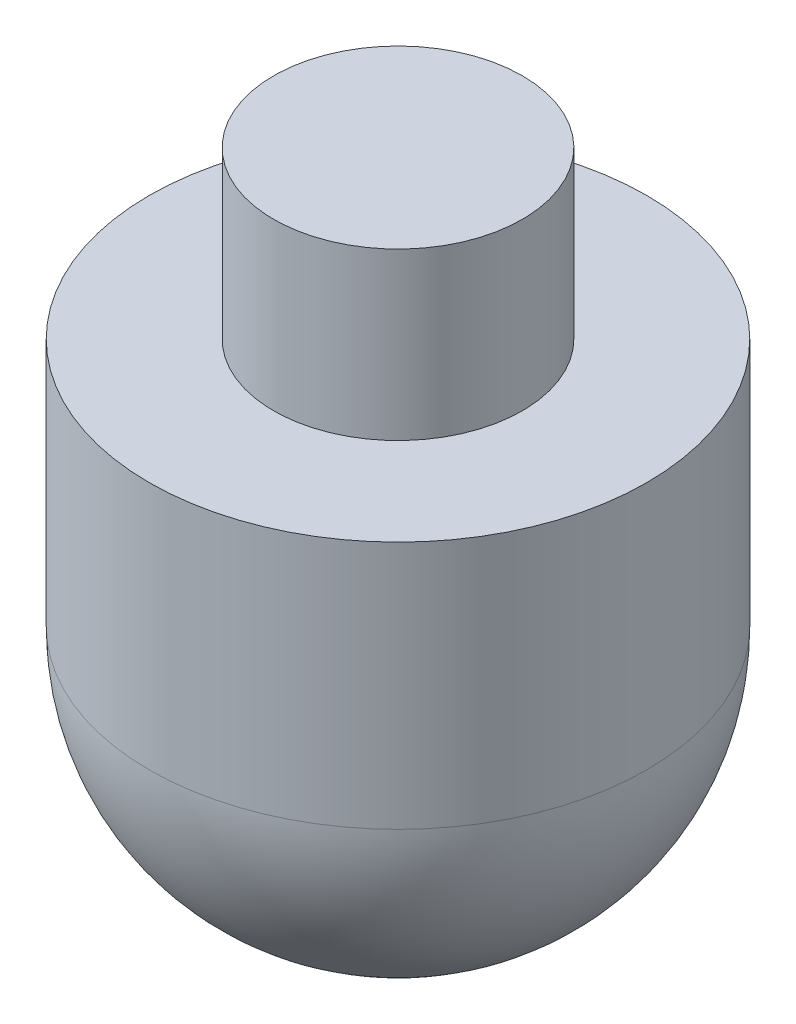
ISO-10303-21;
HEADER;
FILE_DESCRIPTION(('STEP AP214'),'2;1');
FILE_NAME('part.step','',(''),(''),'','','');
FILE_SCHEMA(('AUTOMOTIVE_DESIGN { 1 0 10303 214 1 1 1 1 }'));
ENDSEC;
DATA;
#1=APPLICATION_CONTEXT('core data for automotive mechanical design processes');
#2=APPLICATION_PROTOCOL_DEFINITION('international standard','automotive_design',2000,#1);
#3=PRODUCT_CONTEXT('',#1,'mechanical');
#4=PRODUCT('Part','Part','',(#3));
#5=PRODUCT_RELATED_PRODUCT_CATEGORY('part','',(#4));
#6=PRODUCT_DEFINITION_FORMATION('','',#4);
#7=PRODUCT_DEFINITION_CONTEXT('part definition',#1,'design');
#8=PRODUCT_DEFINITION('design','',#6,#7);
#9=PRODUCT_DEFINITION_SHAPE('','',#8);
#10=(LENGTH_UNIT() NAMED_UNIT(*) SI_UNIT(.MILLI.,.METRE.));
#11=(NAMED_UNIT(*) PLANE_ANGLE_UNIT() SI_UNIT($,.RADIAN.));
#12=(NAMED_UNIT(*) SI_UNIT($,.STERADIAN.) SOLID_ANGLE_UNIT());
#13=UNCERTAINTY_MEASURE_WITH_UNIT(LENGTH_MEASURE(1.E-05),#10,'distance_accuracy_value','');
#14=(GEOMETRIC_REPRESENTATION_CONTEXT(3) GLOBAL_UNCERTAINTY_ASSIGNED_CONTEXT((#13)) GLOBAL_UNIT_ASSIGNED_CONTEXT((#10,
#11,#12)) REPRESENTATION_CONTEXT('',''));
#15=CARTESIAN_POINT('',(0.,0.,0.));
#16=DIRECTION('',(0.,0.,1.));
#17=DIRECTION('',(1.,0.,0.));
#18=AXIS2_PLACEMENT_3D('',#15,#16,#17);
#19=CARTESIAN_POINT('',(0.,41.7049014621742,0.));
#20=DIRECTION('',(0.,1.,0.));
#21=DIRECTION('',(0.,0.,1.));
#22=AXIS2_PLACEMENT_3D('',#19,#20,#21);
#23=PLANE('',#22);
#24=CARTESIAN_POINT('',(0.,41.7049014621742,0.));
#25=DIRECTION('',(0.,-1.,0.));
#26=DIRECTION('',(0.,0.,-1.));
#27=AXIS2_PLACEMENT_3D('',#24,#25,#26);
#28=CIRCLE('',#27,7.5);
#29=CARTESIAN_POINT('',(0.,41.7049014621742,-7.5));
#30=VERTEX_POINT('',#29);
#31=EDGE_CURVE('E40',#30,#30,#28,.T.);
#32=ORIENTED_EDGE('',*,*,#31,.F.);
#33=EDGE_LOOP('',(#32));
#34=FACE_BOUND('',#33,.T.);
#35=ADVANCED_FACE('F33',(#34),#23,.T.);
#36=CARTESIAN_POINT('',(0.,1.70490146217418,0.));
#37=DIRECTION('',(0.,-1.,0.));
#38=DIRECTION('',(0.,0.,-1.));
#39=AXIS2_PLACEMENT_3D('',#36,#37,#38);
#40=CYLINDRICAL_SURFACE('',#39,7.5);
#41=ORIENTED_EDGE('',*,*,#31,.T.);
#42=EDGE_LOOP('',(#41));
#43=FACE_BOUND('',#42,.T.);
#44=CARTESIAN_POINT('',(0.,31.7049014621742,0.));
#45=DIRECTION('',(0.,-1.,0.));
#46=DIRECTION('',(0.,0.,-1.));
#47=AXIS2_PLACEMENT_3D('',#44,#45,#46);
#48=CIRCLE('',#47,7.5);
#49=CARTESIAN_POINT('',(0.,31.7049014621742,-7.5));
#50=VERTEX_POINT('',#49);
#51=EDGE_CURVE('E44',#50,#50,#48,.T.);
#52=ORIENTED_EDGE('',*,*,#51,.F.);
#53=EDGE_LOOP('',(#52));
#54=FACE_BOUND('',#53,.T.);
#55=ADVANCED_FACE('F58',(#43,#54),#40,.T.);
#56=CARTESIAN_POINT('',(7.5,31.7049014621742,0.));
#57=DIRECTION('',(0.,1.,0.));
#58=DIRECTION('',(0.,0.,1.));
#59=AXIS2_PLACEMENT_3D('',#56,#57,#58);
#60=PLANE('',#59);
#61=ORIENTED_EDGE('',*,*,#51,.T.);
#62=EDGE_LOOP('',(#61));
#63=FACE_BOUND('',#62,.T.);
#64=CARTESIAN_POINT('',(0.,31.7049014621742,0.));
#65=DIRECTION('',(0.,-1.,0.));
#66=DIRECTION('',(0.,0.,-1.));
#67=AXIS2_PLACEMENT_3D('',#64,#65,#66);
#68=CIRCLE('',#67,15.);
#69=CARTESIAN_POINT('',(0.,31.7049014621742,-15.));
#70=VERTEX_POINT('',#69);
#71=EDGE_CURVE('E48',#70,#70,#68,.T.);
#72=ORIENTED_EDGE('',*,*,#71,.F.);
#73=EDGE_LOOP('',(#72));
#74=FACE_BOUND('',#73,.T.);
#75=ADVANCED_FACE('F56',(#63,#74),#60,.T.);
#76=CARTESIAN_POINT('',(0.,1.70490146217418,0.));
#77=DIRECTION('',(0.,-1.,0.));
#78=DIRECTION('',(0.,0.,-1.));
#79=AXIS2_PLACEMENT_3D('',#76,#77,#78);
#80=CYLINDRICAL_SURFACE('',#79,15.);
#81=CARTESIAN_POINT('',(0.,16.7049014621742,0.));
#82=DIRECTION('',(0.,-1.,0.));
#83=DIRECTION('',(0.,0.,-1.));
#84=AXIS2_PLACEMENT_3D('',#81,#82,#83);
#85=CIRCLE('',#84,15.);
#86=CARTESIAN_POINT('',(0.,16.7049014621742,-15.));
#87=VERTEX_POINT('',#86);
#88=EDGE_CURVE('E11',#87,#87,#85,.F.);
#89=ORIENTED_EDGE('',*,*,#88,.T.);
#90=EDGE_LOOP('',(#89));
#91=FACE_BOUND('',#90,.T.);
#92=ORIENTED_EDGE('',*,*,#71,.T.);
#93=EDGE_LOOP('',(#92));
#94=FACE_BOUND('',#93,.T.);
#95=ADVANCED_FACE('F54',(#91,#94),#80,.T.);
#96=CARTESIAN_POINT('',(0.,16.7049014621742,0.));
#97=DIRECTION('',(0.,0.,1.));
#98=DIRECTION('',(1.,0.,0.));
#99=AXIS2_PLACEMENT_3D('',#96,#97,#98);
#100=SPHERICAL_SURFACE('',#99,15.);
#101=CARTESIAN_POINT('',(0.,16.7049014621742,0.));
#102=DIRECTION('',(0.,-1.,0.));
#103=DIRECTION('',(0.,0.,-1.));
#104=AXIS2_PLACEMENT_3D('',#101,#102,#103);
#105=SPHERICAL_SURFACE('',#104,15.);
#106=ORIENTED_EDGE('',*,*,#88,.F.);
#107=EDGE_LOOP('',(#106));
#108=FACE_BOUND('',#107,.T.);
#109=ADVANCED_FACE('F35',(#108),#105,.T.);
#110=CLOSED_SHELL('',(#35,#55,#75,#95,#109));
#111=MANIFOLD_SOLID_BREP('B2',#110);
#112=ADVANCED_BREP_SHAPE_REPRESENTATION('',(#18,#111),#14);
#113=SHAPE_DEFINITION_REPRESENTATION(#9,#112);
ENDSEC;
END-ISO-10303-21;
